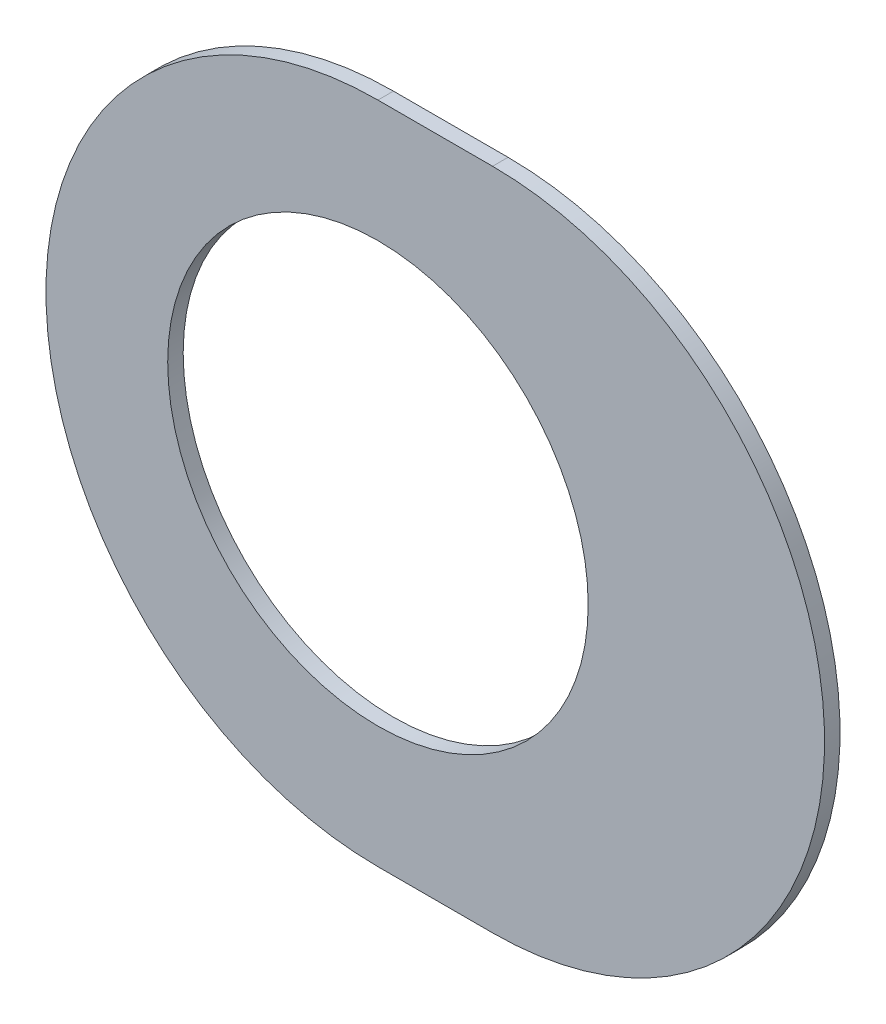
ISO-10303-21;
HEADER;
FILE_DESCRIPTION(('STEP AP214'),'2;1');
FILE_NAME('part.step','',(''),(''),'','','');
FILE_SCHEMA(('AUTOMOTIVE_DESIGN { 1 0 10303 214 1 1 1 1 }'));
ENDSEC;
DATA;
#1=APPLICATION_CONTEXT('core data for automotive mechanical design processes');
#2=APPLICATION_PROTOCOL_DEFINITION('international standard','automotive_design',2000,#1);
#3=PRODUCT_CONTEXT('',#1,'mechanical');
#4=PRODUCT('Part','Part','',(#3));
#5=PRODUCT_RELATED_PRODUCT_CATEGORY('part','',(#4));
#6=PRODUCT_DEFINITION_FORMATION('','',#4);
#7=PRODUCT_DEFINITION_CONTEXT('part definition',#1,'design');
#8=PRODUCT_DEFINITION('design','',#6,#7);
#9=PRODUCT_DEFINITION_SHAPE('','',#8);
#10=(LENGTH_UNIT() NAMED_UNIT(*) SI_UNIT(.MILLI.,.METRE.));
#11=(NAMED_UNIT(*) PLANE_ANGLE_UNIT() SI_UNIT($,.RADIAN.));
#12=(NAMED_UNIT(*) SI_UNIT($,.STERADIAN.) SOLID_ANGLE_UNIT());
#13=UNCERTAINTY_MEASURE_WITH_UNIT(LENGTH_MEASURE(1.E-05),#10,'distance_accuracy_value','');
#14=(GEOMETRIC_REPRESENTATION_CONTEXT(3) GLOBAL_UNCERTAINTY_ASSIGNED_CONTEXT((#13)) GLOBAL_UNIT_ASSIGNED_CONTEXT((#10,
#11,#12)) REPRESENTATION_CONTEXT('',''));
#15=CARTESIAN_POINT('',(0.,0.,0.));
#16=DIRECTION('',(0.,0.,1.));
#17=DIRECTION('',(1.,0.,0.));
#18=AXIS2_PLACEMENT_3D('',#15,#16,#17);
#19=CARTESIAN_POINT('',(113.792,-122.169,-0.045));
#20=DIRECTION('',(0.,0.,-1.));
#21=DIRECTION('',(0.,-1.,0.));
#22=AXIS2_PLACEMENT_3D('',#19,#20,#21);
#23=CYLINDRICAL_SURFACE('',#22,0.475);
#24=CARTESIAN_POINT('',(113.792,-122.169,-0.035));
#25=DIRECTION('',(0.,0.,-1.));
#26=DIRECTION('',(0.,-1.,0.));
#27=AXIS2_PLACEMENT_3D('',#24,#25,#26);
#28=CIRCLE('',#27,0.475);
#29=CARTESIAN_POINT('',(113.792,-122.644,-0.035));
#30=VERTEX_POINT('',#29);
#31=EDGE_CURVE('E86',#30,#30,#28,.T.);
#32=ORIENTED_EDGE('',*,*,#31,.T.);
#33=DIRECTION('',(0.,0.,1.));
#34=VECTOR('',#33,1.);
#35=CARTESIAN_POINT('',(113.792,-122.644,-0.045));
#36=LINE('',#35,#34);
#37=CARTESIAN_POINT('',(113.792,-122.644,0.));
#38=VERTEX_POINT('',#37);
#39=EDGE_CURVE('E11',#30,#38,#36,.T.);
#40=ORIENTED_EDGE('',*,*,#39,.T.);
#41=CARTESIAN_POINT('',(113.792,-122.169,0.));
#42=DIRECTION('',(0.,0.,-1.));
#43=DIRECTION('',(0.,-1.,0.));
#44=AXIS2_PLACEMENT_3D('',#41,#42,#43);
#45=CIRCLE('',#44,0.475);
#46=EDGE_CURVE('E25',#38,#38,#45,.T.);
#47=ORIENTED_EDGE('',*,*,#46,.F.);
#48=ORIENTED_EDGE('',*,*,#39,.F.);
#49=EDGE_LOOP('',(#32,#40,#47,#48));
#50=FACE_BOUND('',#49,.T.);
#51=ADVANCED_FACE('F17',(#50),#23,.F.);
#52=CARTESIAN_POINT('',(114.051,-121.419,-0.035));
#53=DIRECTION('',(0.,-1.,0.));
#54=DIRECTION('',(0.,0.,-1.));
#55=AXIS2_PLACEMENT_3D('',#52,#53,#54);
#56=PLANE('',#55);
#57=DIRECTION('',(-1.,0.,0.));
#58=VECTOR('',#57,1.);
#59=CARTESIAN_POINT('',(114.051,-121.419,-0.035));
#60=LINE('',#59,#58);
#61=CARTESIAN_POINT('',(114.051,-121.419,-0.035));
#62=VERTEX_POINT('',#61);
#63=CARTESIAN_POINT('',(113.792,-121.419,-0.035));
#64=VERTEX_POINT('',#63);
#65=EDGE_CURVE('E75',#62,#64,#60,.T.);
#66=ORIENTED_EDGE('',*,*,#65,.T.);
#67=DIRECTION('',(0.,0.,1.));
#68=VECTOR('',#67,1.);
#69=CARTESIAN_POINT('',(113.792,-121.419,-0.035));
#70=LINE('',#69,#68);
#71=CARTESIAN_POINT('',(113.792,-121.419,0.));
#72=VERTEX_POINT('',#71);
#73=EDGE_CURVE('E78',#64,#72,#70,.T.);
#74=ORIENTED_EDGE('',*,*,#73,.T.);
#75=DIRECTION('',(-1.,0.,0.));
#76=VECTOR('',#75,1.);
#77=CARTESIAN_POINT('',(114.051,-121.419,0.));
#78=LINE('',#77,#76);
#79=CARTESIAN_POINT('',(114.051,-121.419,0.));
#80=VERTEX_POINT('',#79);
#81=EDGE_CURVE('E121',#80,#72,#78,.T.);
#82=ORIENTED_EDGE('',*,*,#81,.F.);
#83=DIRECTION('',(0.,0.,1.));
#84=VECTOR('',#83,1.);
#85=CARTESIAN_POINT('',(114.051,-121.419,-0.035));
#86=LINE('',#85,#84);
#87=EDGE_CURVE('E81',#62,#80,#86,.T.);
#88=ORIENTED_EDGE('',*,*,#87,.F.);
#89=EDGE_LOOP('',(#66,#74,#82,#88));
#90=FACE_BOUND('',#89,.T.);
#91=ADVANCED_FACE('F77',(#90),#56,.F.);
#92=CARTESIAN_POINT('',(113.792,-122.919,0.));
#93=DIRECTION('',(0.,0.,1.));
#94=DIRECTION('',(1.,0.,0.));
#95=AXIS2_PLACEMENT_3D('',#92,#93,#94);
#96=PLANE('',#95);
#97=ORIENTED_EDGE('',*,*,#46,.T.);
#98=EDGE_LOOP('',(#97));
#99=FACE_BOUND('',#98,.T.);
#100=DIRECTION('',(1.,0.,0.));
#101=VECTOR('',#100,1.);
#102=CARTESIAN_POINT('',(113.792,-122.919,0.));
#103=LINE('',#102,#101);
#104=CARTESIAN_POINT('',(113.792,-122.919,0.));
#105=VERTEX_POINT('',#104);
#106=CARTESIAN_POINT('',(114.051,-122.919,0.));
#107=VERTEX_POINT('',#106);
#108=EDGE_CURVE('E111',#105,#107,#103,.T.);
#109=ORIENTED_EDGE('',*,*,#108,.T.);
#110=CARTESIAN_POINT('',(114.051,-122.169,0.));
#111=DIRECTION('',(0.,0.,1.));
#112=DIRECTION('',(0.,-1.,0.));
#113=AXIS2_PLACEMENT_3D('',#110,#111,#112);
#114=CIRCLE('',#113,0.75);
#115=EDGE_CURVE('E87',#107,#80,#114,.T.);
#116=ORIENTED_EDGE('',*,*,#115,.T.);
#117=ORIENTED_EDGE('',*,*,#81,.T.);
#118=CARTESIAN_POINT('',(113.792,-122.169,0.));
#119=DIRECTION('',(0.,0.,1.));
#120=DIRECTION('',(0.,1.,0.));
#121=AXIS2_PLACEMENT_3D('',#118,#119,#120);
#122=CIRCLE('',#121,0.75);
#123=EDGE_CURVE('E94',#72,#105,#122,.T.);
#124=ORIENTED_EDGE('',*,*,#123,.T.);
#125=EDGE_LOOP('',(#109,#116,#117,#124));
#126=FACE_BOUND('',#125,.T.);
#127=ADVANCED_FACE('F135',(#99,#126),#96,.T.);
#128=CARTESIAN_POINT('',(113.792,-122.919,-0.035));
#129=DIRECTION('',(0.,0.,1.));
#130=DIRECTION('',(1.,0.,0.));
#131=AXIS2_PLACEMENT_3D('',#128,#129,#130);
#132=PLANE('',#131);
#133=ORIENTED_EDGE('',*,*,#31,.F.);
#134=EDGE_LOOP('',(#133));
#135=FACE_BOUND('',#134,.T.);
#136=CARTESIAN_POINT('',(113.792,-122.169,-0.035));
#137=DIRECTION('',(0.,0.,1.));
#138=DIRECTION('',(0.,1.,0.));
#139=AXIS2_PLACEMENT_3D('',#136,#137,#138);
#140=CIRCLE('',#139,0.75);
#141=CARTESIAN_POINT('',(113.792,-122.919,-0.035));
#142=VERTEX_POINT('',#141);
#143=EDGE_CURVE('E92',#64,#142,#140,.T.);
#144=ORIENTED_EDGE('',*,*,#143,.F.);
#145=ORIENTED_EDGE('',*,*,#65,.F.);
#146=CARTESIAN_POINT('',(114.051,-122.169,-0.035));
#147=DIRECTION('',(0.,0.,1.));
#148=DIRECTION('',(0.,-1.,0.));
#149=AXIS2_PLACEMENT_3D('',#146,#147,#148);
#150=CIRCLE('',#149,0.75);
#151=CARTESIAN_POINT('',(114.051,-122.919,-0.035));
#152=VERTEX_POINT('',#151);
#153=EDGE_CURVE('E96',#152,#62,#150,.T.);
#154=ORIENTED_EDGE('',*,*,#153,.F.);
#155=DIRECTION('',(1.,0.,0.));
#156=VECTOR('',#155,1.);
#157=CARTESIAN_POINT('',(113.792,-122.919,-0.035));
#158=LINE('',#157,#156);
#159=EDGE_CURVE('E101',#142,#152,#158,.T.);
#160=ORIENTED_EDGE('',*,*,#159,.F.);
#161=EDGE_LOOP('',(#144,#145,#154,#160));
#162=FACE_BOUND('',#161,.T.);
#163=ADVANCED_FACE('F99',(#135,#162),#132,.F.);
#164=CARTESIAN_POINT('',(114.051,-122.169,-0.035));
#165=DIRECTION('',(0.,0.,-1.));
#166=DIRECTION('',(0.,-1.,0.));
#167=AXIS2_PLACEMENT_3D('',#164,#165,#166);
#168=CYLINDRICAL_SURFACE('',#167,0.75);
#169=ORIENTED_EDGE('',*,*,#153,.T.);
#170=ORIENTED_EDGE('',*,*,#87,.T.);
#171=ORIENTED_EDGE('',*,*,#115,.F.);
#172=DIRECTION('',(0.,0.,1.));
#173=VECTOR('',#172,1.);
#174=CARTESIAN_POINT('',(114.051,-122.919,-0.035));
#175=LINE('',#174,#173);
#176=EDGE_CURVE('E238',#152,#107,#175,.T.);
#177=ORIENTED_EDGE('',*,*,#176,.F.);
#178=EDGE_LOOP('',(#169,#170,#171,#177));
#179=FACE_BOUND('',#178,.T.);
#180=ADVANCED_FACE('F134',(#179),#168,.T.);
#181=CARTESIAN_POINT('',(113.792,-122.169,-0.035));
#182=DIRECTION('',(0.,0.,-1.));
#183=DIRECTION('',(0.,1.,0.));
#184=AXIS2_PLACEMENT_3D('',#181,#182,#183);
#185=CYLINDRICAL_SURFACE('',#184,0.75);
#186=ORIENTED_EDGE('',*,*,#143,.T.);
#187=DIRECTION('',(0.,0.,1.));
#188=VECTOR('',#187,1.);
#189=CARTESIAN_POINT('',(113.792,-122.919,-0.035));
#190=LINE('',#189,#188);
#191=EDGE_CURVE('E103',#142,#105,#190,.T.);
#192=ORIENTED_EDGE('',*,*,#191,.T.);
#193=ORIENTED_EDGE('',*,*,#123,.F.);
#194=ORIENTED_EDGE('',*,*,#73,.F.);
#195=EDGE_LOOP('',(#186,#192,#193,#194));
#196=FACE_BOUND('',#195,.T.);
#197=ADVANCED_FACE('F90',(#196),#185,.T.);
#198=CARTESIAN_POINT('',(113.792,-122.919,-0.035));
#199=DIRECTION('',(0.,1.,0.));
#200=DIRECTION('',(1.,0.,0.));
#201=AXIS2_PLACEMENT_3D('',#198,#199,#200);
#202=PLANE('',#201);
#203=ORIENTED_EDGE('',*,*,#159,.T.);
#204=ORIENTED_EDGE('',*,*,#176,.T.);
#205=ORIENTED_EDGE('',*,*,#108,.F.);
#206=ORIENTED_EDGE('',*,*,#191,.F.);
#207=EDGE_LOOP('',(#203,#204,#205,#206));
#208=FACE_BOUND('',#207,.T.);
#209=ADVANCED_FACE('F196',(#208),#202,.F.);
#210=CLOSED_SHELL('',(#51,#91,#127,#163,#180,#197,#209));
#211=MANIFOLD_SOLID_BREP('B1',#210);
#212=ADVANCED_BREP_SHAPE_REPRESENTATION('',(#18,#211),#14);
#213=SHAPE_DEFINITION_REPRESENTATION(#9,#212);
ENDSEC;
END-ISO-10303-21;
